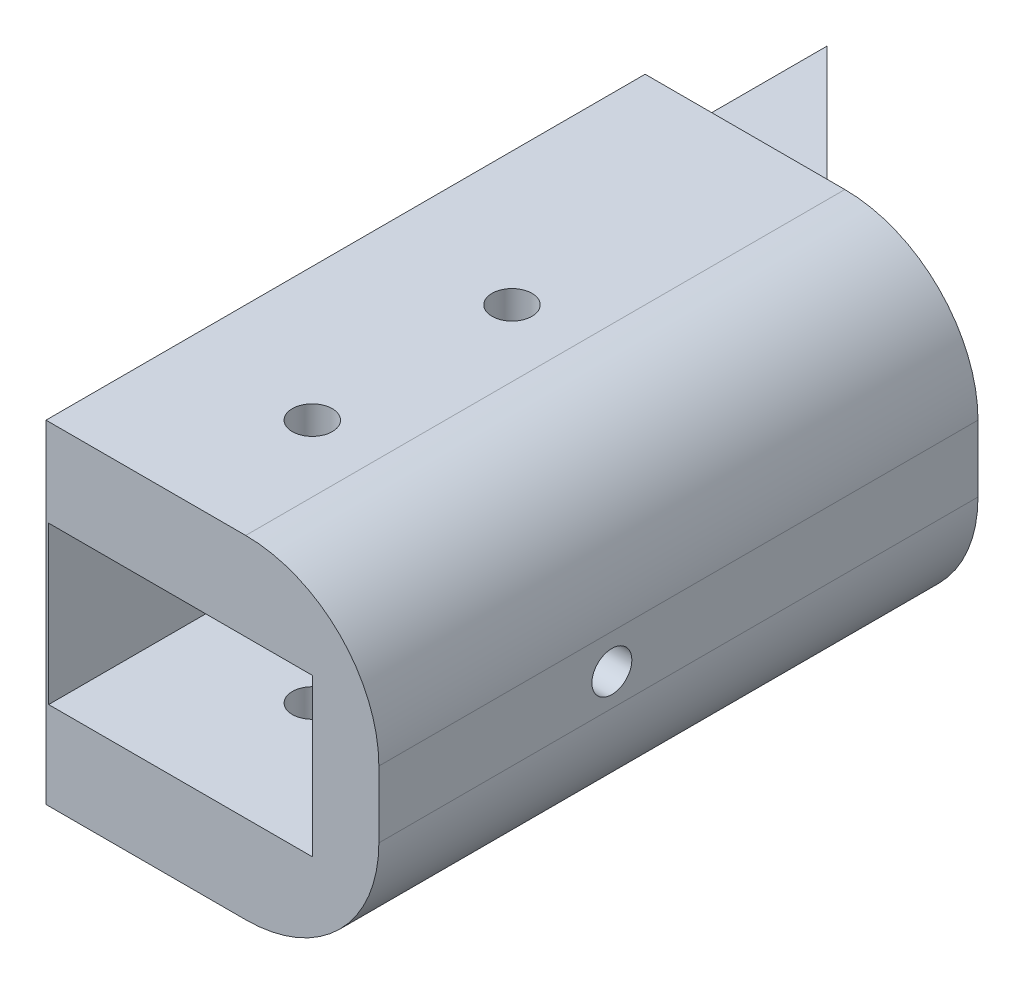
ISO-10303-21;
HEADER;
FILE_DESCRIPTION(('STEP AP214'),'2;1');
FILE_NAME('part.step','',(''),(''),'','','');
FILE_SCHEMA(('AUTOMOTIVE_DESIGN { 1 0 10303 214 1 1 1 1 }'));
ENDSEC;
DATA;
#1=APPLICATION_CONTEXT('core data for automotive mechanical design processes');
#2=APPLICATION_PROTOCOL_DEFINITION('international standard','automotive_design',2000,#1);
#3=PRODUCT_CONTEXT('',#1,'mechanical');
#4=PRODUCT('Part','Part','',(#3));
#5=PRODUCT_RELATED_PRODUCT_CATEGORY('part','',(#4));
#6=PRODUCT_DEFINITION_FORMATION('','',#4);
#7=PRODUCT_DEFINITION_CONTEXT('part definition',#1,'design');
#8=PRODUCT_DEFINITION('design','',#6,#7);
#9=PRODUCT_DEFINITION_SHAPE('','',#8);
#10=(LENGTH_UNIT() NAMED_UNIT(*) SI_UNIT(.MILLI.,.METRE.));
#11=(NAMED_UNIT(*) PLANE_ANGLE_UNIT() SI_UNIT($,.RADIAN.));
#12=(NAMED_UNIT(*) SI_UNIT($,.STERADIAN.) SOLID_ANGLE_UNIT());
#13=UNCERTAINTY_MEASURE_WITH_UNIT(LENGTH_MEASURE(1.E-05),#10,'distance_accuracy_value','');
#14=(GEOMETRIC_REPRESENTATION_CONTEXT(3) GLOBAL_UNCERTAINTY_ASSIGNED_CONTEXT((#13)) GLOBAL_UNIT_ASSIGNED_CONTEXT((#10,
#11,#12)) REPRESENTATION_CONTEXT('',''));
#15=CARTESIAN_POINT('',(0.,0.,0.));
#16=DIRECTION('',(0.,0.,1.));
#17=DIRECTION('',(1.,0.,0.));
#18=AXIS2_PLACEMENT_3D('',#15,#16,#17);
#19=CARTESIAN_POINT('',(-45.,40.,20.2));
#20=DIRECTION('',(1.,0.,0.));
#21=DIRECTION('',(0.,0.,-1.));
#22=AXIS2_PLACEMENT_3D('',#19,#20,#21);
#23=PLANE('',#22);
#24=DIRECTION('',(0.,0.,-1.));
#25=VECTOR('',#24,1.);
#26=CARTESIAN_POINT('',(-45.,-8.,160.2));
#27=LINE('',#26,#25);
#28=CARTESIAN_POINT('',(-45.,-8.,195.2));
#29=VERTEX_POINT('',#28);
#30=CARTESIAN_POINT('',(-45.,-8.,150.2));
#31=VERTEX_POINT('',#30);
#32=EDGE_CURVE('E269',#29,#31,#27,.T.);
#33=ORIENTED_EDGE('',*,*,#32,.F.);
#34=DIRECTION('',(0.,1.,0.));
#35=VECTOR('',#34,1.);
#36=CARTESIAN_POINT('',(-45.,0.,195.2));
#37=LINE('',#36,#35);
#38=CARTESIAN_POINT('',(-45.,17.,195.2));
#39=VERTEX_POINT('',#38);
#40=EDGE_CURVE('E42',#29,#39,#37,.T.);
#41=ORIENTED_EDGE('',*,*,#40,.T.);
#42=DIRECTION('',(0.,0.,1.));
#43=VECTOR('',#42,1.);
#44=CARTESIAN_POINT('',(-45.,17.,160.2));
#45=LINE('',#44,#43);
#46=CARTESIAN_POINT('',(-45.,17.,150.2));
#47=VERTEX_POINT('',#46);
#48=EDGE_CURVE('E270',#47,#39,#45,.T.);
#49=ORIENTED_EDGE('',*,*,#48,.F.);
#50=DIRECTION('',(0.,1.,0.));
#51=VECTOR('',#50,1.);
#52=CARTESIAN_POINT('',(-45.,-3.,150.2));
#53=LINE('',#52,#51);
#54=EDGE_CURVE('E237',#31,#47,#53,.T.);
#55=ORIENTED_EDGE('',*,*,#54,.F.);
#56=EDGE_LOOP('',(#33,#41,#49,#55));
#57=FACE_BOUND('',#56,.T.);
#58=CARTESIAN_POINT('',(-45.,4.4,177.7));
#59=DIRECTION('',(1.,0.,0.));
#60=DIRECTION('',(0.,0.,-1.));
#61=AXIS2_PLACEMENT_3D('',#58,#59,#60);
#62=CIRCLE('',#61,1.5);
#63=CARTESIAN_POINT('',(-45.,4.4,176.2));
#64=VERTEX_POINT('',#63);
#65=EDGE_CURVE('E37',#64,#64,#62,.F.);
#66=ORIENTED_EDGE('',*,*,#65,.F.);
#67=EDGE_LOOP('',(#66));
#68=FACE_BOUND('',#67,.T.);
#69=ADVANCED_FACE('F33',(#57,#68),#23,.F.);
#70=DIRECTION('',(0.,1.,0.));
#71=VECTOR('',#70,1.);
#72=CARTESIAN_POINT('',(-45.,-22.3082531075803,136.547003294764));
#73=LINE('',#72,#71);
#74=CARTESIAN_POINT('',(-45.,-3.,136.547003294764));
#75=VERTEX_POINT('',#74);
#76=CARTESIAN_POINT('',(-45.,12.,136.547003294764));
#77=VERTEX_POINT('',#76);
#78=EDGE_CURVE('E156',#75,#77,#73,.T.);
#79=ORIENTED_EDGE('',*,*,#78,.F.);
#80=DIRECTION('',(0.,0.,-1.));
#81=VECTOR('',#80,1.);
#82=CARTESIAN_POINT('',(-45.,-3.,150.2));
#83=LINE('',#82,#81);
#84=CARTESIAN_POINT('',(-45.,-3.,146.547003294764));
#85=VERTEX_POINT('',#84);
#86=EDGE_CURVE('E267',#85,#75,#83,.T.);
#87=ORIENTED_EDGE('',*,*,#86,.F.);
#88=DIRECTION('',(0.,1.,0.));
#89=VECTOR('',#88,1.);
#90=CARTESIAN_POINT('',(-45.,-22.3082531075803,146.547003294764));
#91=LINE('',#90,#89);
#92=CARTESIAN_POINT('',(-45.,12.,146.547003294764));
#93=VERTEX_POINT('',#92);
#94=EDGE_CURVE('E11',#85,#93,#91,.T.);
#95=ORIENTED_EDGE('',*,*,#94,.T.);
#96=DIRECTION('',(0.,0.,1.));
#97=VECTOR('',#96,1.);
#98=CARTESIAN_POINT('',(-45.,12.,150.2));
#99=LINE('',#98,#97);
#100=EDGE_CURVE('E56',#77,#93,#99,.T.);
#101=ORIENTED_EDGE('',*,*,#100,.F.);
#102=EDGE_LOOP('',(#79,#87,#95,#101));
#103=FACE_BOUND('',#102,.T.);
#104=ADVANCED_FACE('F35',(#103),#23,.F.);
#105=CARTESIAN_POINT('',(-69.,4.4,177.7));
#106=DIRECTION('',(1.,0.,0.));
#107=DIRECTION('',(0.,0.,-1.));
#108=AXIS2_PLACEMENT_3D('',#105,#106,#107);
#109=CYLINDRICAL_SURFACE('',#108,1.5);
#110=CARTESIAN_POINT('',(-25.,4.4,177.7));
#111=DIRECTION('',(-1.,0.,0.));
#112=DIRECTION('',(0.,0.,1.));
#113=AXIS2_PLACEMENT_3D('',#110,#111,#112);
#114=CIRCLE('',#113,1.5);
#115=CARTESIAN_POINT('',(-25.,4.4,179.2));
#116=VERTEX_POINT('',#115);
#117=EDGE_CURVE('E169',#116,#116,#114,.T.);
#118=ORIENTED_EDGE('',*,*,#117,.T.);
#119=EDGE_LOOP('',(#118));
#120=FACE_BOUND('',#119,.T.);
#121=CARTESIAN_POINT('',(-20.,4.4,177.7));
#122=DIRECTION('',(1.,0.,0.));
#123=DIRECTION('',(0.,0.,-1.));
#124=AXIS2_PLACEMENT_3D('',#121,#122,#123);
#125=CIRCLE('',#124,1.5);
#126=CARTESIAN_POINT('',(-20.,4.4,176.2));
#127=VERTEX_POINT('',#126);
#128=EDGE_CURVE('E152',#127,#127,#125,.T.);
#129=ORIENTED_EDGE('',*,*,#128,.T.);
#130=EDGE_LOOP('',(#129));
#131=FACE_BOUND('',#130,.T.);
#132=ADVANCED_FACE('F318',(#120,#131),#109,.F.);
#133=CARTESIAN_POINT('',(0.,0.,160.2));
#134=DIRECTION('',(0.,0.,1.));
#135=DIRECTION('',(1.,0.,0.));
#136=AXIS2_PLACEMENT_3D('',#133,#134,#135);
#137=PLANE('',#136);
#138=DIRECTION('',(0.,1.,0.));
#139=VECTOR('',#138,1.);
#140=CARTESIAN_POINT('',(-25.,-1.4,160.2));
#141=LINE('',#140,#139);
#142=CARTESIAN_POINT('',(-25.,-1.4,160.2));
#143=VERTEX_POINT('',#142);
#144=CARTESIAN_POINT('',(-25.,10.4,160.2));
#145=VERTEX_POINT('',#144);
#146=EDGE_CURVE('E192',#143,#145,#141,.T.);
#147=ORIENTED_EDGE('',*,*,#146,.T.);
#148=DIRECTION('',(-1.,0.,0.));
#149=VECTOR('',#148,1.);
#150=CARTESIAN_POINT('',(-25.,10.4,160.2));
#151=LINE('',#150,#149);
#152=CARTESIAN_POINT('',(-44.8,10.4,160.2));
#153=VERTEX_POINT('',#152);
#154=EDGE_CURVE('E205',#145,#153,#151,.T.);
#155=ORIENTED_EDGE('',*,*,#154,.T.);
#156=DIRECTION('',(0.,-1.,0.));
#157=VECTOR('',#156,1.);
#158=CARTESIAN_POINT('',(-44.8,-1.4,160.2));
#159=LINE('',#158,#157);
#160=CARTESIAN_POINT('',(-44.8,-1.4,160.2));
#161=VERTEX_POINT('',#160);
#162=EDGE_CURVE('E207',#153,#161,#159,.T.);
#163=ORIENTED_EDGE('',*,*,#162,.T.);
#164=DIRECTION('',(1.,0.,0.));
#165=VECTOR('',#164,1.);
#166=CARTESIAN_POINT('',(-25.,-1.4,160.2));
#167=LINE('',#166,#165);
#168=EDGE_CURVE('E196',#161,#143,#167,.T.);
#169=ORIENTED_EDGE('',*,*,#168,.T.);
#170=EDGE_LOOP('',(#147,#155,#163,#169));
#171=FACE_BOUND('',#170,.T.);
#172=ADVANCED_FACE('F323',(#171),#137,.T.);
#173=CARTESIAN_POINT('',(-35.,-13.,170.2));
#174=DIRECTION('',(0.,1.,0.));
#175=DIRECTION('',(0.,0.,1.));
#176=AXIS2_PLACEMENT_3D('',#173,#174,#175);
#177=CYLINDRICAL_SURFACE('',#176,1.5);
#178=CARTESIAN_POINT('',(-35.,-1.4,170.2));
#179=DIRECTION('',(0.,1.,0.));
#180=DIRECTION('',(-1.,0.,0.));
#181=AXIS2_PLACEMENT_3D('',#178,#179,#180);
#182=CIRCLE('',#181,1.5);
#183=CARTESIAN_POINT('',(-36.5,-1.4,170.2));
#184=VERTEX_POINT('',#183);
#185=EDGE_CURVE('E185',#184,#184,#182,.T.);
#186=ORIENTED_EDGE('',*,*,#185,.T.);
#187=EDGE_LOOP('',(#186));
#188=FACE_BOUND('',#187,.T.);
#189=CARTESIAN_POINT('',(-35.,-8.,170.2));
#190=DIRECTION('',(0.,1.,0.));
#191=DIRECTION('',(0.,0.,1.));
#192=AXIS2_PLACEMENT_3D('',#189,#190,#191);
#193=CIRCLE('',#192,1.5);
#194=CARTESIAN_POINT('',(-35.,-8.,171.7));
#195=VERTEX_POINT('',#194);
#196=EDGE_CURVE('E189',#195,#195,#193,.T.);
#197=ORIENTED_EDGE('',*,*,#196,.F.);
#198=EDGE_LOOP('',(#197));
#199=FACE_BOUND('',#198,.T.);
#200=ADVANCED_FACE('F340',(#188,#199),#177,.F.);
#201=CARTESIAN_POINT('',(-35.,-13.,185.2));
#202=DIRECTION('',(0.,1.,0.));
#203=DIRECTION('',(0.,0.,1.));
#204=AXIS2_PLACEMENT_3D('',#201,#202,#203);
#205=CYLINDRICAL_SURFACE('',#204,1.5);
#206=CARTESIAN_POINT('',(-35.,-1.4,185.2));
#207=DIRECTION('',(0.,1.,0.));
#208=DIRECTION('',(-1.,0.,0.));
#209=AXIS2_PLACEMENT_3D('',#206,#207,#208);
#210=CIRCLE('',#209,1.5);
#211=CARTESIAN_POINT('',(-36.5,-1.4,185.2));
#212=VERTEX_POINT('',#211);
#213=EDGE_CURVE('E175',#212,#212,#210,.T.);
#214=ORIENTED_EDGE('',*,*,#213,.T.);
#215=EDGE_LOOP('',(#214));
#216=FACE_BOUND('',#215,.T.);
#217=CARTESIAN_POINT('',(-35.,-8.,185.2));
#218=DIRECTION('',(0.,1.,0.));
#219=DIRECTION('',(0.,0.,1.));
#220=AXIS2_PLACEMENT_3D('',#217,#218,#219);
#221=CIRCLE('',#220,1.5);
#222=CARTESIAN_POINT('',(-35.,-8.,186.7));
#223=VERTEX_POINT('',#222);
#224=EDGE_CURVE('E179',#223,#223,#221,.T.);
#225=ORIENTED_EDGE('',*,*,#224,.F.);
#226=EDGE_LOOP('',(#225));
#227=FACE_BOUND('',#226,.T.);
#228=ADVANCED_FACE('F344',(#216,#227),#205,.F.);
#229=CARTESIAN_POINT('',(0.,0.,150.2));
#230=DIRECTION('',(0.,0.,1.));
#231=DIRECTION('',(1.,0.,0.));
#232=AXIS2_PLACEMENT_3D('',#229,#230,#231);
#233=PLANE('',#232);
#234=DIRECTION('',(1.,0.,0.));
#235=VECTOR('',#234,1.);
#236=CARTESIAN_POINT('',(-55.,-8.,150.2));
#237=LINE('',#236,#235);
#238=CARTESIAN_POINT('',(-30.,-8.,150.2));
#239=VERTEX_POINT('',#238);
#240=EDGE_CURVE('E229',#31,#239,#237,.T.);
#241=ORIENTED_EDGE('',*,*,#240,.F.);
#242=ORIENTED_EDGE('',*,*,#54,.T.);
#243=DIRECTION('',(-1.,0.,0.));
#244=VECTOR('',#243,1.);
#245=CARTESIAN_POINT('',(-55.,17.,150.2));
#246=LINE('',#245,#244);
#247=CARTESIAN_POINT('',(-30.,17.,150.2));
#248=VERTEX_POINT('',#247);
#249=EDGE_CURVE('E234',#248,#47,#246,.T.);
#250=ORIENTED_EDGE('',*,*,#249,.F.);
#251=CARTESIAN_POINT('',(-30.,7.,150.2));
#252=DIRECTION('',(0.,0.,1.));
#253=DIRECTION('',(1.,0.,0.));
#254=AXIS2_PLACEMENT_3D('',#251,#252,#253);
#255=CIRCLE('',#254,10.);
#256=CARTESIAN_POINT('',(-20.,7.,150.2));
#257=VERTEX_POINT('',#256);
#258=EDGE_CURVE('E262',#248,#257,#255,.F.);
#259=ORIENTED_EDGE('',*,*,#258,.T.);
#260=DIRECTION('',(0.,1.,0.));
#261=VECTOR('',#260,1.);
#262=CARTESIAN_POINT('',(-20.,17.,150.2));
#263=LINE('',#262,#261);
#264=CARTESIAN_POINT('',(-20.,2.,150.2));
#265=VERTEX_POINT('',#264);
#266=EDGE_CURVE('E231',#265,#257,#263,.T.);
#267=ORIENTED_EDGE('',*,*,#266,.F.);
#268=CARTESIAN_POINT('',(-30.,2.,150.2));
#269=DIRECTION('',(0.,0.,1.));
#270=DIRECTION('',(1.,0.,0.));
#271=AXIS2_PLACEMENT_3D('',#268,#269,#270);
#272=CIRCLE('',#271,10.);
#273=EDGE_CURVE('E251',#265,#239,#272,.F.);
#274=ORIENTED_EDGE('',*,*,#273,.T.);
#275=EDGE_LOOP('',(#241,#242,#250,#259,#267,#274));
#276=FACE_BOUND('',#275,.T.);
#277=DIRECTION('',(1.,0.,0.));
#278=VECTOR('',#277,1.);
#279=CARTESIAN_POINT('',(-31.3470032947637,12.,150.2));
#280=LINE('',#279,#278);
#281=CARTESIAN_POINT('',(-41.3470032947637,12.,150.2));
#282=VERTEX_POINT('',#281);
#283=CARTESIAN_POINT('',(-31.3470032947637,12.,150.2));
#284=VERTEX_POINT('',#283);
#285=EDGE_CURVE('E141',#282,#284,#280,.T.);
#286=ORIENTED_EDGE('',*,*,#285,.F.);
#287=DIRECTION('',(0.,1.,0.));
#288=VECTOR('',#287,1.);
#289=CARTESIAN_POINT('',(-41.3470032947637,-22.3082531075803,150.2));
#290=LINE('',#289,#288);
#291=CARTESIAN_POINT('',(-41.3470032947637,-3.,150.2));
#292=VERTEX_POINT('',#291);
#293=EDGE_CURVE('E135',#292,#282,#290,.T.);
#294=ORIENTED_EDGE('',*,*,#293,.F.);
#295=DIRECTION('',(-1.,0.,0.));
#296=VECTOR('',#295,1.);
#297=CARTESIAN_POINT('',(-31.3470032947637,-3.,150.2));
#298=LINE('',#297,#296);
#299=CARTESIAN_POINT('',(-31.3470032947637,-3.,150.2));
#300=VERTEX_POINT('',#299);
#301=EDGE_CURVE('E138',#300,#292,#298,.T.);
#302=ORIENTED_EDGE('',*,*,#301,.F.);
#303=DIRECTION('',(0.,1.,0.));
#304=VECTOR('',#303,1.);
#305=CARTESIAN_POINT('',(-31.3470032947637,-22.3082531075803,150.2));
#306=LINE('',#305,#304);
#307=EDGE_CURVE('E142',#300,#284,#306,.T.);
#308=ORIENTED_EDGE('',*,*,#307,.T.);
#309=EDGE_LOOP('',(#286,#294,#302,#308));
#310=FACE_BOUND('',#309,.T.);
#311=ADVANCED_FACE('F137',(#276,#310),#233,.F.);
#312=CARTESIAN_POINT('',(-45.,12.,150.2));
#313=DIRECTION('',(0.,-1.,0.));
#314=DIRECTION('',(1.,0.,0.));
#315=AXIS2_PLACEMENT_3D('',#312,#313,#314);
#316=PLANE('',#315);
#317=DIRECTION('',(-0.707106781186548,0.,-0.707106781186547));
#318=VECTOR('',#317,1.);
#319=CARTESIAN_POINT('',(-45.,12.,136.547003294764));
#320=LINE('',#319,#318);
#321=EDGE_CURVE('E143',#284,#77,#320,.T.);
#322=ORIENTED_EDGE('',*,*,#321,.T.);
#323=ORIENTED_EDGE('',*,*,#100,.T.);
#324=DIRECTION('',(0.70710678118655,0.,0.707106781186545));
#325=VECTOR('',#324,1.);
#326=CARTESIAN_POINT('',(-41.3470032947637,12.,150.2));
#327=LINE('',#326,#325);
#328=EDGE_CURVE('E159',#93,#282,#327,.T.);
#329=ORIENTED_EDGE('',*,*,#328,.T.);
#330=ORIENTED_EDGE('',*,*,#285,.T.);
#331=EDGE_LOOP('',(#322,#323,#329,#330));
#332=FACE_BOUND('',#331,.T.);
#333=ADVANCED_FACE('F343',(#332),#316,.F.);
#334=CARTESIAN_POINT('',(-45.,-3.,150.2));
#335=DIRECTION('',(0.,1.,0.));
#336=DIRECTION('',(-1.,0.,0.));
#337=AXIS2_PLACEMENT_3D('',#334,#335,#336);
#338=PLANE('',#337);
#339=DIRECTION('',(-0.70710678118655,0.,-0.707106781186545));
#340=VECTOR('',#339,1.);
#341=CARTESIAN_POINT('',(-41.3470032947637,-3.,150.2));
#342=LINE('',#341,#340);
#343=EDGE_CURVE('E148',#292,#85,#342,.T.);
#344=ORIENTED_EDGE('',*,*,#343,.T.);
#345=ORIENTED_EDGE('',*,*,#86,.T.);
#346=DIRECTION('',(0.707106781186548,0.,0.707106781186547));
#347=VECTOR('',#346,1.);
#348=CARTESIAN_POINT('',(-45.,-3.,136.547003294764));
#349=LINE('',#348,#347);
#350=EDGE_CURVE('E150',#75,#300,#349,.T.);
#351=ORIENTED_EDGE('',*,*,#350,.T.);
#352=ORIENTED_EDGE('',*,*,#301,.T.);
#353=EDGE_LOOP('',(#344,#345,#351,#352));
#354=FACE_BOUND('',#353,.T.);
#355=ADVANCED_FACE('F147',(#354),#338,.F.);
#356=CARTESIAN_POINT('',(-45.,-22.3082531075803,136.547003294764));
#357=DIRECTION('',(0.707106781186547,0.,-0.707106781186548));
#358=DIRECTION('',(-0.707106781186548,0.,-0.707106781186547));
#359=AXIS2_PLACEMENT_3D('',#356,#357,#358);
#360=PLANE('',#359);
#361=ORIENTED_EDGE('',*,*,#350,.F.);
#362=ORIENTED_EDGE('',*,*,#78,.T.);
#363=ORIENTED_EDGE('',*,*,#321,.F.);
#364=ORIENTED_EDGE('',*,*,#307,.F.);
#365=EDGE_LOOP('',(#361,#362,#363,#364));
#366=FACE_BOUND('',#365,.T.);
#367=ADVANCED_FACE('F368',(#366),#360,.T.);
#368=CARTESIAN_POINT('',(-41.3470032947637,-22.3082531075803,150.2));
#369=DIRECTION('',(-0.707106781186545,0.,0.70710678118655));
#370=DIRECTION('',(0.70710678118655,0.,0.707106781186545));
#371=AXIS2_PLACEMENT_3D('',#368,#369,#370);
#372=PLANE('',#371);
#373=ORIENTED_EDGE('',*,*,#343,.F.);
#374=ORIENTED_EDGE('',*,*,#293,.T.);
#375=ORIENTED_EDGE('',*,*,#328,.F.);
#376=ORIENTED_EDGE('',*,*,#94,.F.);
#377=EDGE_LOOP('',(#373,#374,#375,#376));
#378=FACE_BOUND('',#377,.T.);
#379=ADVANCED_FACE('F154',(#378),#372,.T.);
#380=CARTESIAN_POINT('',(-35.,10.4,170.2));
#381=DIRECTION('',(0.,-1.,0.));
#382=DIRECTION('',(1.,0.,0.));
#383=AXIS2_PLACEMENT_3D('',#380,#381,#382);
#384=CIRCLE('',#383,1.5);
#385=CARTESIAN_POINT('',(-33.5,10.4,170.2));
#386=VERTEX_POINT('',#385);
#387=EDGE_CURVE('E186',#386,#386,#384,.T.);
#388=ORIENTED_EDGE('',*,*,#387,.T.);
#389=EDGE_LOOP('',(#388));
#390=FACE_BOUND('',#389,.T.);
#391=CARTESIAN_POINT('',(-35.,17.,170.2));
#392=DIRECTION('',(0.,1.,0.));
#393=DIRECTION('',(0.,0.,1.));
#394=AXIS2_PLACEMENT_3D('',#391,#392,#393);
#395=CIRCLE('',#394,1.5);
#396=CARTESIAN_POINT('',(-35.,17.,171.7));
#397=VERTEX_POINT('',#396);
#398=EDGE_CURVE('E182',#397,#397,#395,.T.);
#399=ORIENTED_EDGE('',*,*,#398,.T.);
#400=EDGE_LOOP('',(#399));
#401=FACE_BOUND('',#400,.T.);
#402=ADVANCED_FACE('F356',(#390,#401),#177,.F.);
#403=CARTESIAN_POINT('',(-35.,10.4,185.2));
#404=DIRECTION('',(0.,-1.,0.));
#405=DIRECTION('',(1.,0.,0.));
#406=AXIS2_PLACEMENT_3D('',#403,#404,#405);
#407=CIRCLE('',#406,1.5);
#408=CARTESIAN_POINT('',(-33.5,10.4,185.2));
#409=VERTEX_POINT('',#408);
#410=EDGE_CURVE('E176',#409,#409,#407,.T.);
#411=ORIENTED_EDGE('',*,*,#410,.T.);
#412=EDGE_LOOP('',(#411));
#413=FACE_BOUND('',#412,.T.);
#414=CARTESIAN_POINT('',(-35.,17.,185.2));
#415=DIRECTION('',(0.,1.,0.));
#416=DIRECTION('',(0.,0.,1.));
#417=AXIS2_PLACEMENT_3D('',#414,#415,#416);
#418=CIRCLE('',#417,1.5);
#419=CARTESIAN_POINT('',(-35.,17.,186.7));
#420=VERTEX_POINT('',#419);
#421=EDGE_CURVE('E172',#420,#420,#418,.T.);
#422=ORIENTED_EDGE('',*,*,#421,.T.);
#423=EDGE_LOOP('',(#422));
#424=FACE_BOUND('',#423,.T.);
#425=ADVANCED_FACE('F358',(#413,#424),#205,.F.);
#426=CARTESIAN_POINT('',(-44.8,-1.4,195.2));
#427=DIRECTION('',(1.,0.,0.));
#428=DIRECTION('',(0.,0.,-1.));
#429=AXIS2_PLACEMENT_3D('',#426,#427,#428);
#430=PLANE('',#429);
#431=CARTESIAN_POINT('',(-44.8,4.4,177.7));
#432=DIRECTION('',(1.,0.,0.));
#433=DIRECTION('',(0.,0.,-1.));
#434=AXIS2_PLACEMENT_3D('',#431,#432,#433);
#435=CIRCLE('',#434,1.5);
#436=CARTESIAN_POINT('',(-44.8,4.4,176.2));
#437=VERTEX_POINT('',#436);
#438=EDGE_CURVE('E168',#437,#437,#435,.T.);
#439=ORIENTED_EDGE('',*,*,#438,.F.);
#440=EDGE_LOOP('',(#439));
#441=FACE_BOUND('',#440,.T.);
#442=ORIENTED_EDGE('',*,*,#162,.F.);
#443=DIRECTION('',(0.,0.,-1.));
#444=VECTOR('',#443,1.);
#445=CARTESIAN_POINT('',(-44.8,10.4,195.2));
#446=LINE('',#445,#444);
#447=CARTESIAN_POINT('',(-44.8,10.4,195.2));
#448=VERTEX_POINT('',#447);
#449=EDGE_CURVE('E215',#448,#153,#446,.T.);
#450=ORIENTED_EDGE('',*,*,#449,.F.);
#451=DIRECTION('',(0.,-1.,0.));
#452=VECTOR('',#451,1.);
#453=CARTESIAN_POINT('',(-44.8,-1.4,195.2));
#454=LINE('',#453,#452);
#455=CARTESIAN_POINT('',(-44.8,-1.4,195.2));
#456=VERTEX_POINT('',#455);
#457=EDGE_CURVE('E198',#448,#456,#454,.T.);
#458=ORIENTED_EDGE('',*,*,#457,.T.);
#459=DIRECTION('',(0.,0.,-1.));
#460=VECTOR('',#459,1.);
#461=CARTESIAN_POINT('',(-44.8,-1.4,195.2));
#462=LINE('',#461,#460);
#463=EDGE_CURVE('E212',#456,#161,#462,.T.);
#464=ORIENTED_EDGE('',*,*,#463,.T.);
#465=EDGE_LOOP('',(#442,#450,#458,#464));
#466=FACE_BOUND('',#465,.T.);
#467=ADVANCED_FACE('F365',(#441,#466),#430,.T.);
#468=ORIENTED_EDGE('',*,*,#65,.T.);
#469=EDGE_LOOP('',(#468));
#470=FACE_BOUND('',#469,.T.);
#471=ORIENTED_EDGE('',*,*,#438,.T.);
#472=EDGE_LOOP('',(#471));
#473=FACE_BOUND('',#472,.T.);
#474=ADVANCED_FACE('F326',(#470,#473),#109,.F.);
#475=CARTESIAN_POINT('',(-25.,-1.4,195.2));
#476=DIRECTION('',(0.,1.,0.));
#477=DIRECTION('',(-1.,0.,0.));
#478=AXIS2_PLACEMENT_3D('',#475,#476,#477);
#479=PLANE('',#478);
#480=ORIENTED_EDGE('',*,*,#213,.F.);
#481=EDGE_LOOP('',(#480));
#482=FACE_BOUND('',#481,.T.);
#483=ORIENTED_EDGE('',*,*,#185,.F.);
#484=EDGE_LOOP('',(#483));
#485=FACE_BOUND('',#484,.T.);
#486=ORIENTED_EDGE('',*,*,#168,.F.);
#487=ORIENTED_EDGE('',*,*,#463,.F.);
#488=DIRECTION('',(1.,0.,0.));
#489=VECTOR('',#488,1.);
#490=CARTESIAN_POINT('',(-25.,-1.4,195.2));
#491=LINE('',#490,#489);
#492=CARTESIAN_POINT('',(-25.,-1.4,195.2));
#493=VERTEX_POINT('',#492);
#494=EDGE_CURVE('E201',#456,#493,#491,.T.);
#495=ORIENTED_EDGE('',*,*,#494,.T.);
#496=DIRECTION('',(0.,0.,-1.));
#497=VECTOR('',#496,1.);
#498=CARTESIAN_POINT('',(-25.,-1.4,195.2));
#499=LINE('',#498,#497);
#500=EDGE_CURVE('E203',#493,#143,#499,.T.);
#501=ORIENTED_EDGE('',*,*,#500,.T.);
#502=EDGE_LOOP('',(#486,#487,#495,#501));
#503=FACE_BOUND('',#502,.T.);
#504=ADVANCED_FACE('F382',(#482,#485,#503),#479,.T.);
#505=CARTESIAN_POINT('',(-25.,-1.4,195.2));
#506=DIRECTION('',(-1.,0.,0.));
#507=DIRECTION('',(0.,0.,1.));
#508=AXIS2_PLACEMENT_3D('',#505,#506,#507);
#509=PLANE('',#508);
#510=ORIENTED_EDGE('',*,*,#117,.F.);
#511=EDGE_LOOP('',(#510));
#512=FACE_BOUND('',#511,.T.);
#513=ORIENTED_EDGE('',*,*,#146,.F.);
#514=ORIENTED_EDGE('',*,*,#500,.F.);
#515=DIRECTION('',(0.,1.,0.));
#516=VECTOR('',#515,1.);
#517=CARTESIAN_POINT('',(-25.,-1.4,195.2));
#518=LINE('',#517,#516);
#519=CARTESIAN_POINT('',(-25.,10.4,195.2));
#520=VERTEX_POINT('',#519);
#521=EDGE_CURVE('E193',#493,#520,#518,.T.);
#522=ORIENTED_EDGE('',*,*,#521,.T.);
#523=DIRECTION('',(0.,0.,-1.));
#524=VECTOR('',#523,1.);
#525=CARTESIAN_POINT('',(-25.,10.4,195.2));
#526=LINE('',#525,#524);
#527=EDGE_CURVE('E218',#520,#145,#526,.T.);
#528=ORIENTED_EDGE('',*,*,#527,.T.);
#529=EDGE_LOOP('',(#513,#514,#522,#528));
#530=FACE_BOUND('',#529,.T.);
#531=ADVANCED_FACE('F336',(#512,#530),#509,.T.);
#532=CARTESIAN_POINT('',(-25.,10.4,195.2));
#533=DIRECTION('',(0.,-1.,0.));
#534=DIRECTION('',(1.,0.,0.));
#535=AXIS2_PLACEMENT_3D('',#532,#533,#534);
#536=PLANE('',#535);
#537=ORIENTED_EDGE('',*,*,#410,.F.);
#538=EDGE_LOOP('',(#537));
#539=FACE_BOUND('',#538,.T.);
#540=ORIENTED_EDGE('',*,*,#387,.F.);
#541=EDGE_LOOP('',(#540));
#542=FACE_BOUND('',#541,.T.);
#543=ORIENTED_EDGE('',*,*,#154,.F.);
#544=ORIENTED_EDGE('',*,*,#527,.F.);
#545=DIRECTION('',(-1.,0.,0.));
#546=VECTOR('',#545,1.);
#547=CARTESIAN_POINT('',(-25.,10.4,195.2));
#548=LINE('',#547,#546);
#549=EDGE_CURVE('E195',#520,#448,#548,.T.);
#550=ORIENTED_EDGE('',*,*,#549,.T.);
#551=ORIENTED_EDGE('',*,*,#449,.T.);
#552=EDGE_LOOP('',(#543,#544,#550,#551));
#553=FACE_BOUND('',#552,.T.);
#554=ADVANCED_FACE('F346',(#539,#542,#553),#536,.T.);
#555=CARTESIAN_POINT('',(-55.,17.,160.2));
#556=DIRECTION('',(0.,-1.,0.));
#557=DIRECTION('',(0.,0.,-1.));
#558=AXIS2_PLACEMENT_3D('',#555,#556,#557);
#559=PLANE('',#558);
#560=ORIENTED_EDGE('',*,*,#421,.F.);
#561=EDGE_LOOP('',(#560));
#562=FACE_BOUND('',#561,.T.);
#563=ORIENTED_EDGE('',*,*,#398,.F.);
#564=EDGE_LOOP('',(#563));
#565=FACE_BOUND('',#564,.T.);
#566=ORIENTED_EDGE('',*,*,#249,.T.);
#567=ORIENTED_EDGE('',*,*,#48,.T.);
#568=DIRECTION('',(-1.,0.,0.));
#569=VECTOR('',#568,1.);
#570=CARTESIAN_POINT('',(-20.,17.,195.2));
#571=LINE('',#570,#569);
#572=CARTESIAN_POINT('',(-30.,17.,195.2));
#573=VERTEX_POINT('',#572);
#574=EDGE_CURVE('E224',#573,#39,#571,.T.);
#575=ORIENTED_EDGE('',*,*,#574,.F.);
#576=DIRECTION('',(0.,0.,1.));
#577=VECTOR('',#576,1.);
#578=CARTESIAN_POINT('',(-30.,17.,160.2));
#579=LINE('',#578,#577);
#580=EDGE_CURVE('E259',#573,#248,#579,.F.);
#581=ORIENTED_EDGE('',*,*,#580,.T.);
#582=EDGE_LOOP('',(#566,#567,#575,#581));
#583=FACE_BOUND('',#582,.T.);
#584=ADVANCED_FACE('F296',(#562,#565,#583),#559,.F.);
#585=CARTESIAN_POINT('',(-30.,7.,160.2));
#586=DIRECTION('',(0.,0.,1.));
#587=DIRECTION('',(1.,0.,0.));
#588=AXIS2_PLACEMENT_3D('',#585,#586,#587);
#589=CYLINDRICAL_SURFACE('',#588,10.);
#590=DIRECTION('',(0.,0.,1.));
#591=VECTOR('',#590,1.);
#592=CARTESIAN_POINT('',(-20.,7.,160.2));
#593=LINE('',#592,#591);
#594=CARTESIAN_POINT('',(-20.,7.,195.2));
#595=VERTEX_POINT('',#594);
#596=EDGE_CURVE('E256',#257,#595,#593,.T.);
#597=ORIENTED_EDGE('',*,*,#596,.F.);
#598=ORIENTED_EDGE('',*,*,#258,.F.);
#599=ORIENTED_EDGE('',*,*,#580,.F.);
#600=CARTESIAN_POINT('',(-30.,7.,195.2));
#601=DIRECTION('',(0.,0.,1.));
#602=DIRECTION('',(1.,0.,0.));
#603=AXIS2_PLACEMENT_3D('',#600,#601,#602);
#604=CIRCLE('',#603,10.);
#605=EDGE_CURVE('E264',#595,#573,#604,.T.);
#606=ORIENTED_EDGE('',*,*,#605,.F.);
#607=EDGE_LOOP('',(#597,#598,#599,#606));
#608=FACE_BOUND('',#607,.T.);
#609=ADVANCED_FACE('F300',(#608),#589,.T.);
#610=CARTESIAN_POINT('',(-20.,17.,160.2));
#611=DIRECTION('',(-1.,0.,0.));
#612=DIRECTION('',(0.,0.,1.));
#613=AXIS2_PLACEMENT_3D('',#610,#611,#612);
#614=PLANE('',#613);
#615=ORIENTED_EDGE('',*,*,#128,.F.);
#616=EDGE_LOOP('',(#615));
#617=FACE_BOUND('',#616,.T.);
#618=ORIENTED_EDGE('',*,*,#266,.T.);
#619=ORIENTED_EDGE('',*,*,#596,.T.);
#620=DIRECTION('',(0.,1.,0.));
#621=VECTOR('',#620,1.);
#622=CARTESIAN_POINT('',(-20.,-8.,195.2));
#623=LINE('',#622,#621);
#624=CARTESIAN_POINT('',(-20.,2.,195.2));
#625=VERTEX_POINT('',#624);
#626=EDGE_CURVE('E221',#625,#595,#623,.T.);
#627=ORIENTED_EDGE('',*,*,#626,.F.);
#628=DIRECTION('',(0.,0.,1.));
#629=VECTOR('',#628,1.);
#630=CARTESIAN_POINT('',(-20.,2.,160.2));
#631=LINE('',#630,#629);
#632=EDGE_CURVE('E248',#625,#265,#631,.F.);
#633=ORIENTED_EDGE('',*,*,#632,.T.);
#634=EDGE_LOOP('',(#618,#619,#627,#633));
#635=FACE_BOUND('',#634,.T.);
#636=ADVANCED_FACE('F302',(#617,#635),#614,.F.);
#637=CARTESIAN_POINT('',(-30.,2.,160.2));
#638=DIRECTION('',(0.,0.,1.));
#639=DIRECTION('',(1.,0.,0.));
#640=AXIS2_PLACEMENT_3D('',#637,#638,#639);
#641=CYLINDRICAL_SURFACE('',#640,10.);
#642=DIRECTION('',(0.,0.,1.));
#643=VECTOR('',#642,1.);
#644=CARTESIAN_POINT('',(-30.,-8.,160.2));
#645=LINE('',#644,#643);
#646=CARTESIAN_POINT('',(-30.,-8.,195.2));
#647=VERTEX_POINT('',#646);
#648=EDGE_CURVE('E239',#239,#647,#645,.T.);
#649=ORIENTED_EDGE('',*,*,#648,.F.);
#650=ORIENTED_EDGE('',*,*,#273,.F.);
#651=ORIENTED_EDGE('',*,*,#632,.F.);
#652=CARTESIAN_POINT('',(-30.,2.,195.2));
#653=DIRECTION('',(0.,0.,1.));
#654=DIRECTION('',(1.,0.,0.));
#655=AXIS2_PLACEMENT_3D('',#652,#653,#654);
#656=CIRCLE('',#655,10.);
#657=EDGE_CURVE('E254',#647,#625,#656,.T.);
#658=ORIENTED_EDGE('',*,*,#657,.F.);
#659=EDGE_LOOP('',(#649,#650,#651,#658));
#660=FACE_BOUND('',#659,.T.);
#661=ADVANCED_FACE('F288',(#660),#641,.T.);
#662=CARTESIAN_POINT('',(-55.,-8.,160.2));
#663=DIRECTION('',(0.,1.,0.));
#664=DIRECTION('',(0.,0.,1.));
#665=AXIS2_PLACEMENT_3D('',#662,#663,#664);
#666=PLANE('',#665);
#667=ORIENTED_EDGE('',*,*,#224,.T.);
#668=EDGE_LOOP('',(#667));
#669=FACE_BOUND('',#668,.T.);
#670=ORIENTED_EDGE('',*,*,#196,.T.);
#671=EDGE_LOOP('',(#670));
#672=FACE_BOUND('',#671,.T.);
#673=DIRECTION('',(1.,0.,0.));
#674=VECTOR('',#673,1.);
#675=CARTESIAN_POINT('',(-20.,-8.,195.2));
#676=LINE('',#675,#674);
#677=EDGE_CURVE('E227',#29,#647,#676,.T.);
#678=ORIENTED_EDGE('',*,*,#677,.F.);
#679=ORIENTED_EDGE('',*,*,#32,.T.);
#680=ORIENTED_EDGE('',*,*,#240,.T.);
#681=ORIENTED_EDGE('',*,*,#648,.T.);
#682=EDGE_LOOP('',(#678,#679,#680,#681));
#683=FACE_BOUND('',#682,.T.);
#684=ADVANCED_FACE('F278',(#669,#672,#683),#666,.F.);
#685=CARTESIAN_POINT('',(0.,0.,195.2));
#686=DIRECTION('',(0.,0.,1.));
#687=DIRECTION('',(1.,0.,0.));
#688=AXIS2_PLACEMENT_3D('',#685,#686,#687);
#689=PLANE('',#688);
#690=ORIENTED_EDGE('',*,*,#40,.F.);
#691=ORIENTED_EDGE('',*,*,#677,.T.);
#692=ORIENTED_EDGE('',*,*,#657,.T.);
#693=ORIENTED_EDGE('',*,*,#626,.T.);
#694=ORIENTED_EDGE('',*,*,#605,.T.);
#695=ORIENTED_EDGE('',*,*,#574,.T.);
#696=EDGE_LOOP('',(#690,#691,#692,#693,#694,#695));
#697=FACE_BOUND('',#696,.T.);
#698=ORIENTED_EDGE('',*,*,#549,.F.);
#699=ORIENTED_EDGE('',*,*,#521,.F.);
#700=ORIENTED_EDGE('',*,*,#494,.F.);
#701=ORIENTED_EDGE('',*,*,#457,.F.);
#702=EDGE_LOOP('',(#698,#699,#700,#701));
#703=FACE_BOUND('',#702,.T.);
#704=ADVANCED_FACE('F291',(#697,#703),#689,.T.);
#705=CLOSED_SHELL('',(#69,#104,#132,#172,#200,#228,#311,#333,#355,#367,#379,#402,#425,#467,#474,
#504,#531,#554,#584,#609,#636,#661,#684,#704));
#706=MANIFOLD_SOLID_BREP('B2',#705);
#707=ADVANCED_BREP_SHAPE_REPRESENTATION('',(#18,#706),#14);
#708=SHAPE_DEFINITION_REPRESENTATION(#9,#707);
ENDSEC;
END-ISO-10303-21;
